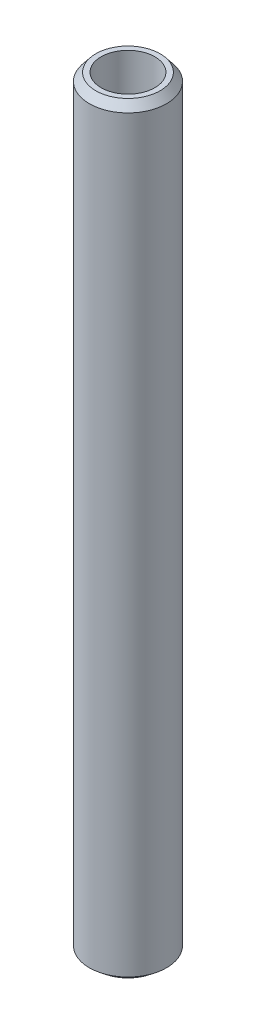
ISO-10303-21;
HEADER;
FILE_DESCRIPTION(('STEP AP214'),'2;1');
FILE_NAME('part.step','',(''),(''),'','','');
FILE_SCHEMA(('AUTOMOTIVE_DESIGN { 1 0 10303 214 1 1 1 1 }'));
ENDSEC;
DATA;
#1=APPLICATION_CONTEXT('core data for automotive mechanical design processes');
#2=APPLICATION_PROTOCOL_DEFINITION('international standard','automotive_design',2000,#1);
#3=PRODUCT_CONTEXT('',#1,'mechanical');
#4=PRODUCT('Part','Part','',(#3));
#5=PRODUCT_RELATED_PRODUCT_CATEGORY('part','',(#4));
#6=PRODUCT_DEFINITION_FORMATION('','',#4);
#7=PRODUCT_DEFINITION_CONTEXT('part definition',#1,'design');
#8=PRODUCT_DEFINITION('design','',#6,#7);
#9=PRODUCT_DEFINITION_SHAPE('','',#8);
#10=(LENGTH_UNIT() NAMED_UNIT(*) SI_UNIT(.MILLI.,.METRE.));
#11=(NAMED_UNIT(*) PLANE_ANGLE_UNIT() SI_UNIT($,.RADIAN.));
#12=(NAMED_UNIT(*) SI_UNIT($,.STERADIAN.) SOLID_ANGLE_UNIT());
#13=UNCERTAINTY_MEASURE_WITH_UNIT(LENGTH_MEASURE(1.E-05),#10,'distance_accuracy_value','');
#14=(GEOMETRIC_REPRESENTATION_CONTEXT(3) GLOBAL_UNCERTAINTY_ASSIGNED_CONTEXT((#13)) GLOBAL_UNIT_ASSIGNED_CONTEXT((#10,
#11,#12)) REPRESENTATION_CONTEXT('',''));
#15=CARTESIAN_POINT('',(0.,0.,0.));
#16=DIRECTION('',(0.,0.,1.));
#17=DIRECTION('',(1.,0.,0.));
#18=AXIS2_PLACEMENT_3D('',#15,#16,#17);
#19=CARTESIAN_POINT('',(0.,444.679747437873,0.));
#20=DIRECTION('',(0.,-1.,0.));
#21=DIRECTION('',(0.,0.,-1.));
#22=AXIS2_PLACEMENT_3D('',#19,#20,#21);
#23=CYLINDRICAL_SURFACE('',#22,22.5);
#24=CARTESIAN_POINT('',(0.,440.032095288594,0.));
#25=DIRECTION('',(0.,1.,0.));
#26=DIRECTION('',(0.,0.,1.));
#27=AXIS2_PLACEMENT_3D('',#24,#25,#26);
#28=CIRCLE('',#27,22.5);
#29=CARTESIAN_POINT('',(0.,440.032095288594,22.5));
#30=VERTEX_POINT('',#29);
#31=EDGE_CURVE('E50',#30,#30,#28,.F.);
#32=ORIENTED_EDGE('',*,*,#31,.T.);
#33=EDGE_LOOP('',(#32));
#34=FACE_BOUND('',#33,.T.);
#35=CARTESIAN_POINT('',(0.,3.76444223721611,0.));
#36=DIRECTION('',(0.,1.,0.));
#37=DIRECTION('',(0.,0.,1.));
#38=AXIS2_PLACEMENT_3D('',#35,#36,#37);
#39=CIRCLE('',#38,22.5);
#40=CARTESIAN_POINT('',(0.,3.76444223721611,22.5));
#41=VERTEX_POINT('',#40);
#42=EDGE_CURVE('E51',#41,#41,#39,.T.);
#43=ORIENTED_EDGE('',*,*,#42,.T.);
#44=EDGE_LOOP('',(#43));
#45=FACE_BOUND('',#44,.T.);
#46=ADVANCED_FACE('F39',(#34,#45),#23,.T.);
#47=CARTESIAN_POINT('',(0.,444.679747437873,0.));
#48=DIRECTION('',(0.,1.,0.));
#49=DIRECTION('',(0.,0.,1.));
#50=AXIS2_PLACEMENT_3D('',#47,#48,#49);
#51=PLANE('',#50);
#52=CARTESIAN_POINT('',(0.,444.679747437873,0.));
#53=DIRECTION('',(0.,1.,0.));
#54=DIRECTION('',(0.,0.,1.));
#55=AXIS2_PLACEMENT_3D('',#52,#53,#54);
#56=CIRCLE('',#55,18.7355577627838);
#57=CARTESIAN_POINT('',(0.,444.679747437873,18.7355577627838));
#58=VERTEX_POINT('',#57);
#59=EDGE_CURVE('E54',#58,#58,#56,.T.);
#60=ORIENTED_EDGE('',*,*,#59,.T.);
#61=EDGE_LOOP('',(#60));
#62=FACE_BOUND('',#61,.T.);
#63=CARTESIAN_POINT('',(0.,444.679747437873,0.));
#64=DIRECTION('',(0.,1.,0.));
#65=DIRECTION('',(0.,0.,1.));
#66=AXIS2_PLACEMENT_3D('',#63,#64,#65);
#67=CIRCLE('',#66,15.6587405917009);
#68=CARTESIAN_POINT('',(0.,444.679747437873,15.6587405917009));
#69=VERTEX_POINT('',#68);
#70=EDGE_CURVE('E58',#69,#69,#67,.T.);
#71=ORIENTED_EDGE('',*,*,#70,.F.);
#72=EDGE_LOOP('',(#71));
#73=FACE_BOUND('',#72,.T.);
#74=ADVANCED_FACE('F69',(#62,#73),#51,.T.);
#75=CARTESIAN_POINT('',(0.,0.,0.));
#76=DIRECTION('',(0.,1.,0.));
#77=DIRECTION('',(0.,0.,1.));
#78=AXIS2_PLACEMENT_3D('',#75,#76,#77);
#79=PLANE('',#78);
#80=CARTESIAN_POINT('',(0.,0.,0.));
#81=DIRECTION('',(0.,1.,0.));
#82=DIRECTION('',(0.,0.,1.));
#83=AXIS2_PLACEMENT_3D('',#80,#81,#82);
#84=CIRCLE('',#83,17.8523478507213);
#85=CARTESIAN_POINT('',(0.,0.,17.8523478507213));
#86=VERTEX_POINT('',#85);
#87=EDGE_CURVE('E10',#86,#86,#84,.F.);
#88=ORIENTED_EDGE('',*,*,#87,.T.);
#89=EDGE_LOOP('',(#88));
#90=FACE_BOUND('',#89,.T.);
#91=CARTESIAN_POINT('',(0.,0.,0.));
#92=DIRECTION('',(0.,1.,0.));
#93=DIRECTION('',(0.,0.,1.));
#94=AXIS2_PLACEMENT_3D('',#91,#92,#93);
#95=CIRCLE('',#94,15.6587405917009);
#96=CARTESIAN_POINT('',(0.,0.,15.6587405917009));
#97=VERTEX_POINT('',#96);
#98=EDGE_CURVE('E63',#97,#97,#95,.T.);
#99=ORIENTED_EDGE('',*,*,#98,.T.);
#100=EDGE_LOOP('',(#99));
#101=FACE_BOUND('',#100,.T.);
#102=ADVANCED_FACE('F75',(#90,#101),#79,.F.);
#103=CARTESIAN_POINT('',(0.,444.679747437873,0.));
#104=DIRECTION('',(0.,-1.,0.));
#105=DIRECTION('',(0.,0.,-1.));
#106=AXIS2_PLACEMENT_3D('',#103,#104,#105);
#107=CYLINDRICAL_SURFACE('',#106,15.6587405917009);
#108=ORIENTED_EDGE('',*,*,#70,.T.);
#109=EDGE_LOOP('',(#108));
#110=FACE_BOUND('',#109,.T.);
#111=ORIENTED_EDGE('',*,*,#98,.F.);
#112=EDGE_LOOP('',(#111));
#113=FACE_BOUND('',#112,.T.);
#114=ADVANCED_FACE('F70',(#110,#113),#107,.F.);
#115=CARTESIAN_POINT('',(0.,444.679747437873,0.));
#116=DIRECTION('',(0.,-1.,0.));
#117=DIRECTION('',(0.,0.,-1.));
#118=AXIS2_PLACEMENT_3D('',#115,#116,#117);
#119=CONICAL_SURFACE('',#118,18.7355577627838,0.680788560404381);
#120=ORIENTED_EDGE('',*,*,#31,.F.);
#121=EDGE_LOOP('',(#120));
#122=FACE_BOUND('',#121,.T.);
#123=ORIENTED_EDGE('',*,*,#59,.F.);
#124=EDGE_LOOP('',(#123));
#125=FACE_BOUND('',#124,.T.);
#126=ADVANCED_FACE('F81',(#122,#125),#119,.T.);
#127=CARTESIAN_POINT('',(0.,3.76444223721611,0.));
#128=DIRECTION('',(0.,1.,0.));
#129=DIRECTION('',(0.,0.,1.));
#130=AXIS2_PLACEMENT_3D('',#127,#128,#129);
#131=CONICAL_SURFACE('',#130,22.5,0.890007766390514);
#132=CARTESIAN_POINT('',(0.,0.,17.8523478507213));
#133=CARTESIAN_POINT('',(0.,0.0392129399710013,17.9007608939429));
#134=CARTESIAN_POINT('',(0.,0.0784258799420023,17.9491739371646));
#135=CARTESIAN_POINT('',(0.,0.156851759884005,18.0460000236079));
#136=CARTESIAN_POINT('',(0.,0.196064699855006,18.0944130668295));
#137=CARTESIAN_POINT('',(0.,0.274490579797008,18.1912391532728));
#138=CARTESIAN_POINT('',(0.,0.313703519768009,18.2396521964945));
#139=CARTESIAN_POINT('',(0.,0.392129399710012,18.3364782829378));
#140=CARTESIAN_POINT('',(0.,0.431342339681013,18.3848913261595));
#141=CARTESIAN_POINT('',(0.,0.509768219623015,18.4817174126028));
#142=CARTESIAN_POINT('',(0.,0.548981159594016,18.5301304558244));
#143=CARTESIAN_POINT('',(0.,0.627407039536019,18.6269565422677));
#144=CARTESIAN_POINT('',(0.,0.66661997950702,18.6753695854894));
#145=CARTESIAN_POINT('',(0.,0.745045859449022,18.7721956719327));
#146=CARTESIAN_POINT('',(0.,0.784258799420023,18.8206087151543));
#147=CARTESIAN_POINT('',(0.,0.862684679362026,18.9174348015976));
#148=CARTESIAN_POINT('',(0.,0.901897619333027,18.9658478448193));
#149=CARTESIAN_POINT('',(0.,0.98032349927503,19.0626739312626));
#150=CARTESIAN_POINT('',(0.,1.01953643924603,19.1110869744843));
#151=CARTESIAN_POINT('',(0.,1.09796231918803,19.2079130609276));
#152=CARTESIAN_POINT('',(0.,1.13717525915903,19.2563261041492));
#153=CARTESIAN_POINT('',(0.,1.21560113910104,19.3531521905925));
#154=CARTESIAN_POINT('',(0.,1.25481407907204,19.4015652338142));
#155=CARTESIAN_POINT('',(0.,1.33323995901404,19.4983913202575));
#156=CARTESIAN_POINT('',(0.,1.37245289898504,19.5468043634791));
#157=CARTESIAN_POINT('',(0.,1.45087877892704,19.6436304499224));
#158=CARTESIAN_POINT('',(0.,1.49009171889805,19.6920434931441));
#159=CARTESIAN_POINT('',(0.,1.56851759884005,19.7888695795874));
#160=CARTESIAN_POINT('',(0.,1.60773053881105,19.8372826228091));
#161=CARTESIAN_POINT('',(0.,1.68615641875305,19.9341087092524));
#162=CARTESIAN_POINT('',(0.,1.72536935872405,19.982521752474));
#163=CARTESIAN_POINT('',(0.,1.80379523866606,20.0793478389173));
#164=CARTESIAN_POINT('',(0.,1.84300817863706,20.127760882139));
#165=CARTESIAN_POINT('',(0.,1.92143405857906,20.2245869685823));
#166=CARTESIAN_POINT('',(0.,1.96064699855006,20.2730000118039));
#167=CARTESIAN_POINT('',(0.,2.03907287849206,20.3698260982472));
#168=CARTESIAN_POINT('',(0.,2.07828581846306,20.4182391414689));
#169=CARTESIAN_POINT('',(0.,2.15671169840507,20.5150652279122));
#170=CARTESIAN_POINT('',(0.,2.19592463837607,20.5634782711339));
#171=CARTESIAN_POINT('',(0.,2.27435051831807,20.6603043575772));
#172=CARTESIAN_POINT('',(0.,2.31356345828907,20.7087174007988));
#173=CARTESIAN_POINT('',(0.,2.39198933823107,20.8055434872421));
#174=CARTESIAN_POINT('',(0.,2.43120227820207,20.8539565304638));
#175=CARTESIAN_POINT('',(0.,2.50962815814408,20.9507826169071));
#176=CARTESIAN_POINT('',(0.,2.54884109811508,20.9991956601287));
#177=CARTESIAN_POINT('',(0.,2.62726697805708,21.096021746572));
#178=CARTESIAN_POINT('',(0.,2.66647991802808,21.1444347897937));
#179=CARTESIAN_POINT('',(0.,2.74490579797008,21.241260876237));
#180=CARTESIAN_POINT('',(0.,2.78411873794108,21.2896739194587));
#181=CARTESIAN_POINT('',(0.,2.86254461788309,21.386500005902));
#182=CARTESIAN_POINT('',(0.,2.90175755785409,21.4349130491236));
#183=CARTESIAN_POINT('',(0.,2.98018343779609,21.5317391355669));
#184=CARTESIAN_POINT('',(0.,3.01939637776709,21.5801521787886));
#185=CARTESIAN_POINT('',(0.,3.09782225770909,21.6769782652319));
#186=CARTESIAN_POINT('',(0.,3.1370351976801,21.7253913084535));
#187=CARTESIAN_POINT('',(0.,3.2154610776221,21.8222173948969));
#188=CARTESIAN_POINT('',(0.,3.2546740175931,21.8706304381185));
#189=CARTESIAN_POINT('',(0.,3.3330998975351,21.9674565245618));
#190=CARTESIAN_POINT('',(0.,3.3723128375061,22.0158695677835));
#191=CARTESIAN_POINT('',(0.,3.45073871744811,22.1126956542268));
#192=CARTESIAN_POINT('',(0.,3.48995165741911,22.1611086974484));
#193=CARTESIAN_POINT('',(0.,3.56837753736111,22.2579347838917));
#194=CARTESIAN_POINT('',(0.,3.60759047733211,22.3063478271134));
#195=CARTESIAN_POINT('',(0.,3.68601635727411,22.4031739135567));
#196=CARTESIAN_POINT('',(0.,3.72522929724511,22.4515869567783));
#197=CARTESIAN_POINT('',(0.,3.76444223721611,22.5));
#198=B_SPLINE_CURVE_WITH_KNOTS('',3,(#132,#133,#134,#135,#136,#137,#138,#139,#140,#141,#142,
#143,#144,#145,#146,#147,#148,#149,#150,#151,#152,#153,#154,#155,#156,#157,#158,#159,#160,#161,
#162,#163,#164,#165,#166,#167,#168,#169,#170,#171,#172,#173,#174,#175,#176,#177,#178,#179,#180,
#181,#182,#183,#184,#185,#186,#187,#188,#189,#190,#191,#192,#193,#194,#195,#196,#197),
.UNSPECIFIED.,.F.,.F.,(4,2,2,2,2,2,2,2,2,2,2,2,2,2,2,2,2,2,2,2,2,2,2,2,2,2,2,2,2,2,2,2,4),(0.,
0.186904512348842,0.373809024697687,0.560713537046532,0.747618049395377,0.934522561744222,
1.12142707409307,1.30833158644191,1.49523609879075,1.6821406111396,1.86904512348844,
2.05594963583729,2.24285414818613,2.42975866053498,2.61666317288382,2.80356768523266,
2.99047219758151,3.17737670993035,3.3642812222792,3.55118573462804,3.73809024697689,
3.92499475932573,4.11189927167457,4.29880378402342,4.48570829637226,4.67261280872111,
4.85951732106995,5.0464218334188,5.23332634576764,5.42023085811648,5.60713537046533,
5.79403988281417,5.98094439516302),.UNSPECIFIED.);
#199=EDGE_CURVE('BSEAM45',#86,#41,#198,.T.);
#200=ORIENTED_EDGE('',*,*,#87,.F.);
#201=ORIENTED_EDGE('',*,*,#42,.F.);
#202=ORIENTED_EDGE('',*,*,#199,.T.);
#203=ORIENTED_EDGE('',*,*,#199,.F.);
#204=EDGE_LOOP('',(#200,#202,#201,#203));
#205=FACE_BOUND('',#204,.T.);
#206=ADVANCED_FACE('F45',(#205),#131,.T.);
#207=CLOSED_SHELL('',(#46,#74,#102,#114,#126,#206));
#208=MANIFOLD_SOLID_BREP('B2',#207);
#209=ADVANCED_BREP_SHAPE_REPRESENTATION('',(#18,#208),#14);
#210=SHAPE_DEFINITION_REPRESENTATION(#9,#209);
ENDSEC;
END-ISO-10303-21;
